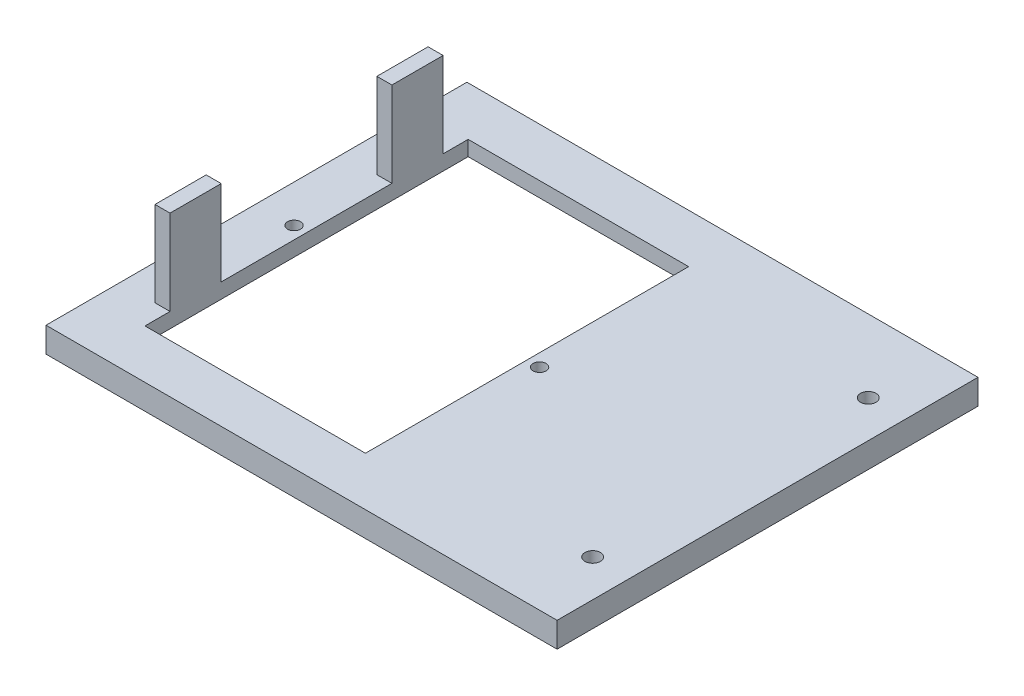
ISO-10303-21;
HEADER;
FILE_DESCRIPTION(('STEP AP214'),'2;1');
FILE_NAME('part.step','',(''),(''),'','','');
FILE_SCHEMA(('AUTOMOTIVE_DESIGN { 1 0 10303 214 1 1 1 1 }'));
ENDSEC;
DATA;
#1=APPLICATION_CONTEXT('core data for automotive mechanical design processes');
#2=APPLICATION_PROTOCOL_DEFINITION('international standard','automotive_design',2000,#1);
#3=PRODUCT_CONTEXT('',#1,'mechanical');
#4=PRODUCT('Part','Part','',(#3));
#5=PRODUCT_RELATED_PRODUCT_CATEGORY('part','',(#4));
#6=PRODUCT_DEFINITION_FORMATION('','',#4);
#7=PRODUCT_DEFINITION_CONTEXT('part definition',#1,'design');
#8=PRODUCT_DEFINITION('design','',#6,#7);
#9=PRODUCT_DEFINITION_SHAPE('','',#8);
#10=(LENGTH_UNIT() NAMED_UNIT(*) SI_UNIT(.MILLI.,.METRE.));
#11=(NAMED_UNIT(*) PLANE_ANGLE_UNIT() SI_UNIT($,.RADIAN.));
#12=(NAMED_UNIT(*) SI_UNIT($,.STERADIAN.) SOLID_ANGLE_UNIT());
#13=UNCERTAINTY_MEASURE_WITH_UNIT(LENGTH_MEASURE(1.E-05),#10,'distance_accuracy_value','');
#14=(GEOMETRIC_REPRESENTATION_CONTEXT(3) GLOBAL_UNCERTAINTY_ASSIGNED_CONTEXT((#13)) GLOBAL_UNIT_ASSIGNED_CONTEXT((#10,
#11,#12)) REPRESENTATION_CONTEXT('',''));
#15=CARTESIAN_POINT('',(0.,0.,0.));
#16=DIRECTION('',(0.,0.,1.));
#17=DIRECTION('',(1.,0.,0.));
#18=AXIS2_PLACEMENT_3D('',#15,#16,#17);
#19=CARTESIAN_POINT('',(0.,5.,0.));
#20=DIRECTION('',(0.,1.,0.));
#21=DIRECTION('',(0.,0.,1.));
#22=AXIS2_PLACEMENT_3D('',#19,#20,#21);
#23=PLANE('',#22);
#24=CARTESIAN_POINT('',(-47.5,5.,0.));
#25=DIRECTION('',(0.,1.,0.));
#26=DIRECTION('',(0.,0.,1.));
#27=AXIS2_PLACEMENT_3D('',#24,#25,#26);
#28=CIRCLE('',#27,1.3);
#29=CARTESIAN_POINT('',(-47.5,5.,1.30000000000001));
#30=VERTEX_POINT('',#29);
#31=EDGE_CURVE('E352',#30,#30,#28,.F.);
#32=ORIENTED_EDGE('',*,*,#31,.T.);
#33=EDGE_LOOP('',(#32));
#34=FACE_BOUND('',#33,.T.);
#35=CARTESIAN_POINT('',(1.50000000000001,5.,0.));
#36=DIRECTION('',(0.,1.,0.));
#37=DIRECTION('',(0.,0.,1.));
#38=AXIS2_PLACEMENT_3D('',#35,#36,#37);
#39=CIRCLE('',#38,1.3);
#40=CARTESIAN_POINT('',(1.50000000000001,5.,1.3));
#41=VERTEX_POINT('',#40);
#42=EDGE_CURVE('E346',#41,#41,#39,.F.);
#43=ORIENTED_EDGE('',*,*,#42,.T.);
#44=EDGE_LOOP('',(#43));
#45=FACE_BOUND('',#44,.T.);
#46=DIRECTION('',(-1.,0.,0.));
#47=VECTOR('',#46,1.);
#48=CARTESIAN_POINT('',(0.,5.,27.25));
#49=LINE('',#48,#47);
#50=CARTESIAN_POINT('',(-45.,5.,27.25));
#51=VERTEX_POINT('',#50);
#52=CARTESIAN_POINT('',(-48.,5.,27.25));
#53=VERTEX_POINT('',#52);
#54=EDGE_CURVE('E295',#51,#53,#49,.T.);
#55=ORIENTED_EDGE('',*,*,#54,.T.);
#56=DIRECTION('',(0.,0.,-1.));
#57=VECTOR('',#56,1.);
#58=CARTESIAN_POINT('',(-48.,5.,0.));
#59=LINE('',#58,#57);
#60=CARTESIAN_POINT('',(-48.,5.,17.0363673677213));
#61=VERTEX_POINT('',#60);
#62=EDGE_CURVE('E288',#53,#61,#59,.T.);
#63=ORIENTED_EDGE('',*,*,#62,.T.);
#64=DIRECTION('',(-1.,0.,0.));
#65=VECTOR('',#64,1.);
#66=CARTESIAN_POINT('',(0.,5.,17.0363673677213));
#67=LINE('',#66,#65);
#68=CARTESIAN_POINT('',(-45.,5.,17.0363673677213));
#69=VERTEX_POINT('',#68);
#70=EDGE_CURVE('E292',#69,#61,#67,.T.);
#71=ORIENTED_EDGE('',*,*,#70,.F.);
#72=DIRECTION('',(0.,0.,1.));
#73=VECTOR('',#72,1.);
#74=CARTESIAN_POINT('',(-45.,5.,-32.25));
#75=LINE('',#74,#73);
#76=CARTESIAN_POINT('',(-45.,5.,-17.0363673677213));
#77=VERTEX_POINT('',#76);
#78=EDGE_CURVE('E228',#77,#69,#75,.T.);
#79=ORIENTED_EDGE('',*,*,#78,.F.);
#80=DIRECTION('',(-1.,0.,0.));
#81=VECTOR('',#80,1.);
#82=CARTESIAN_POINT('',(0.,5.,-17.0363673677213));
#83=LINE('',#82,#81);
#84=CARTESIAN_POINT('',(-48.,5.,-17.0363673677213));
#85=VERTEX_POINT('',#84);
#86=EDGE_CURVE('E261',#77,#85,#83,.T.);
#87=ORIENTED_EDGE('',*,*,#86,.T.);
#88=DIRECTION('',(0.,0.,1.));
#89=VECTOR('',#88,1.);
#90=CARTESIAN_POINT('',(-48.,5.,0.));
#91=LINE('',#90,#89);
#92=CARTESIAN_POINT('',(-48.,5.,-27.25));
#93=VERTEX_POINT('',#92);
#94=EDGE_CURVE('E264',#93,#85,#91,.T.);
#95=ORIENTED_EDGE('',*,*,#94,.F.);
#96=DIRECTION('',(-1.,0.,0.));
#97=VECTOR('',#96,1.);
#98=CARTESIAN_POINT('',(0.,5.,-27.25));
#99=LINE('',#98,#97);
#100=CARTESIAN_POINT('',(-45.,5.,-27.25));
#101=VERTEX_POINT('',#100);
#102=EDGE_CURVE('E267',#101,#93,#99,.T.);
#103=ORIENTED_EDGE('',*,*,#102,.F.);
#104=CARTESIAN_POINT('',(-45.,5.,-32.25));
#105=VERTEX_POINT('',#104);
#106=EDGE_CURVE('E225',#105,#101,#75,.T.);
#107=ORIENTED_EDGE('',*,*,#106,.F.);
#108=DIRECTION('',(-1.,0.,0.));
#109=VECTOR('',#108,1.);
#110=CARTESIAN_POINT('',(-45.,5.,-32.25));
#111=LINE('',#110,#109);
#112=CARTESIAN_POINT('',(-0.999999999999995,5.,-32.25));
#113=VERTEX_POINT('',#112);
#114=EDGE_CURVE('E230',#113,#105,#111,.T.);
#115=ORIENTED_EDGE('',*,*,#114,.F.);
#116=DIRECTION('',(0.,0.,-1.));
#117=VECTOR('',#116,1.);
#118=CARTESIAN_POINT('',(-0.999999999999995,5.,-32.25));
#119=LINE('',#118,#117);
#120=CARTESIAN_POINT('',(-0.999999999999987,5.,32.25));
#121=VERTEX_POINT('',#120);
#122=EDGE_CURVE('E233',#121,#113,#119,.T.);
#123=ORIENTED_EDGE('',*,*,#122,.F.);
#124=DIRECTION('',(1.,0.,0.));
#125=VECTOR('',#124,1.);
#126=CARTESIAN_POINT('',(-45.,5.,32.25));
#127=LINE('',#126,#125);
#128=CARTESIAN_POINT('',(-45.,5.,32.25));
#129=VERTEX_POINT('',#128);
#130=EDGE_CURVE('E220',#129,#121,#127,.T.);
#131=ORIENTED_EDGE('',*,*,#130,.F.);
#132=EDGE_CURVE('E229',#51,#129,#75,.T.);
#133=ORIENTED_EDGE('',*,*,#132,.F.);
#134=EDGE_LOOP('',(#55,#63,#71,#79,#87,#95,#103,#107,#115,#123,#131,#133));
#135=FACE_BOUND('',#134,.T.);
#136=CARTESIAN_POINT('',(39.6,5.,-27.5));
#137=DIRECTION('',(0.,1.,0.));
#138=DIRECTION('',(0.,0.,1.));
#139=AXIS2_PLACEMENT_3D('',#136,#137,#138);
#140=CIRCLE('',#139,1.55);
#141=CARTESIAN_POINT('',(39.6,5.,-25.95));
#142=VERTEX_POINT('',#141);
#143=EDGE_CURVE('E240',#142,#142,#140,.T.);
#144=ORIENTED_EDGE('',*,*,#143,.F.);
#145=EDGE_LOOP('',(#144));
#146=FACE_BOUND('',#145,.T.);
#147=CARTESIAN_POINT('',(39.6,5.,27.5));
#148=DIRECTION('',(0.,-1.,0.));
#149=DIRECTION('',(0.,0.,-1.));
#150=AXIS2_PLACEMENT_3D('',#147,#148,#149);
#151=CIRCLE('',#150,1.55);
#152=CARTESIAN_POINT('',(39.6,5.,25.95));
#153=VERTEX_POINT('',#152);
#154=EDGE_CURVE('E244',#153,#153,#151,.T.);
#155=ORIENTED_EDGE('',*,*,#154,.T.);
#156=EDGE_LOOP('',(#155));
#157=FACE_BOUND('',#156,.T.);
#158=DIRECTION('',(1.,0.,0.));
#159=VECTOR('',#158,1.);
#160=CARTESIAN_POINT('',(-55.,5.,42.));
#161=LINE('',#160,#159);
#162=CARTESIAN_POINT('',(-55.,5.,42.));
#163=VERTEX_POINT('',#162);
#164=CARTESIAN_POINT('',(47.,5.,42.));
#165=VERTEX_POINT('',#164);
#166=EDGE_CURVE('E203',#163,#165,#161,.T.);
#167=ORIENTED_EDGE('',*,*,#166,.T.);
#168=DIRECTION('',(0.,0.,1.));
#169=VECTOR('',#168,1.);
#170=CARTESIAN_POINT('',(47.,5.,42.));
#171=LINE('',#170,#169);
#172=CARTESIAN_POINT('',(47.,5.,-42.));
#173=VERTEX_POINT('',#172);
#174=EDGE_CURVE('E53',#173,#165,#171,.T.);
#175=ORIENTED_EDGE('',*,*,#174,.F.);
#176=DIRECTION('',(-1.,0.,0.));
#177=VECTOR('',#176,1.);
#178=CARTESIAN_POINT('',(-55.,5.,-42.));
#179=LINE('',#178,#177);
#180=CARTESIAN_POINT('',(-55.,5.,-42.));
#181=VERTEX_POINT('',#180);
#182=EDGE_CURVE('E195',#173,#181,#179,.T.);
#183=ORIENTED_EDGE('',*,*,#182,.T.);
#184=DIRECTION('',(0.,0.,1.));
#185=VECTOR('',#184,1.);
#186=CARTESIAN_POINT('',(-55.,5.,-42.));
#187=LINE('',#186,#185);
#188=EDGE_CURVE('E198',#181,#163,#187,.T.);
#189=ORIENTED_EDGE('',*,*,#188,.T.);
#190=EDGE_LOOP('',(#167,#175,#183,#189));
#191=FACE_BOUND('',#190,.T.);
#192=ADVANCED_FACE('F38',(#34,#45,#135,#146,#157,#191),#23,.T.);
#193=CARTESIAN_POINT('',(0.,0.,0.));
#194=DIRECTION('',(0.,1.,0.));
#195=DIRECTION('',(0.,0.,1.));
#196=AXIS2_PLACEMENT_3D('',#193,#194,#195);
#197=PLANE('',#196);
#198=CARTESIAN_POINT('',(39.6,0.,27.5));
#199=DIRECTION('',(0.,-1.,0.));
#200=DIRECTION('',(0.,0.,-1.));
#201=AXIS2_PLACEMENT_3D('',#198,#199,#200);
#202=CIRCLE('',#201,1.55);
#203=CARTESIAN_POINT('',(39.6,0.,25.95));
#204=VERTEX_POINT('',#203);
#205=EDGE_CURVE('E236',#204,#204,#202,.T.);
#206=ORIENTED_EDGE('',*,*,#205,.F.);
#207=EDGE_LOOP('',(#206));
#208=FACE_BOUND('',#207,.T.);
#209=CARTESIAN_POINT('',(39.6,0.,-27.5));
#210=DIRECTION('',(0.,1.,0.));
#211=DIRECTION('',(0.,0.,1.));
#212=AXIS2_PLACEMENT_3D('',#209,#210,#211);
#213=CIRCLE('',#212,1.55);
#214=CARTESIAN_POINT('',(39.6,0.,-25.95));
#215=VERTEX_POINT('',#214);
#216=EDGE_CURVE('E237',#215,#215,#213,.T.);
#217=ORIENTED_EDGE('',*,*,#216,.T.);
#218=EDGE_LOOP('',(#217));
#219=FACE_BOUND('',#218,.T.);
#220=DIRECTION('',(-1.,0.,0.));
#221=VECTOR('',#220,1.);
#222=CARTESIAN_POINT('',(4.00000000000001,0.,37.25));
#223=LINE('',#222,#221);
#224=CARTESIAN_POINT('',(4.00000000000001,0.,37.25));
#225=VERTEX_POINT('',#224);
#226=CARTESIAN_POINT('',(-50.,0.,37.25));
#227=VERTEX_POINT('',#226);
#228=EDGE_CURVE('E331',#225,#227,#223,.T.);
#229=ORIENTED_EDGE('',*,*,#228,.F.);
#230=DIRECTION('',(0.,0.,1.));
#231=VECTOR('',#230,1.);
#232=CARTESIAN_POINT('',(4.00000000000001,0.,37.25));
#233=LINE('',#232,#231);
#234=CARTESIAN_POINT('',(4.00000000000002,0.,-37.25));
#235=VERTEX_POINT('',#234);
#236=EDGE_CURVE('E61',#235,#225,#233,.T.);
#237=ORIENTED_EDGE('',*,*,#236,.F.);
#238=DIRECTION('',(1.,0.,0.));
#239=VECTOR('',#238,1.);
#240=CARTESIAN_POINT('',(4.00000000000002,0.,-37.25));
#241=LINE('',#240,#239);
#242=CARTESIAN_POINT('',(-50.,0.,-37.25));
#243=VERTEX_POINT('',#242);
#244=EDGE_CURVE('E324',#243,#235,#241,.T.);
#245=ORIENTED_EDGE('',*,*,#244,.F.);
#246=DIRECTION('',(0.,0.,-1.));
#247=VECTOR('',#246,1.);
#248=CARTESIAN_POINT('',(-50.,0.,37.25));
#249=LINE('',#248,#247);
#250=EDGE_CURVE('E328',#227,#243,#249,.T.);
#251=ORIENTED_EDGE('',*,*,#250,.F.);
#252=EDGE_LOOP('',(#229,#237,#245,#251));
#253=FACE_BOUND('',#252,.T.);
#254=DIRECTION('',(0.,0.,-1.));
#255=VECTOR('',#254,1.);
#256=CARTESIAN_POINT('',(47.,0.,42.));
#257=LINE('',#256,#255);
#258=CARTESIAN_POINT('',(47.,0.,42.));
#259=VERTEX_POINT('',#258);
#260=CARTESIAN_POINT('',(47.,0.,-42.));
#261=VERTEX_POINT('',#260);
#262=EDGE_CURVE('E175',#259,#261,#257,.T.);
#263=ORIENTED_EDGE('',*,*,#262,.F.);
#264=DIRECTION('',(1.,0.,0.));
#265=VECTOR('',#264,1.);
#266=CARTESIAN_POINT('',(-55.,0.,42.));
#267=LINE('',#266,#265);
#268=CARTESIAN_POINT('',(-55.,0.,42.));
#269=VERTEX_POINT('',#268);
#270=EDGE_CURVE('E187',#269,#259,#267,.T.);
#271=ORIENTED_EDGE('',*,*,#270,.F.);
#272=DIRECTION('',(0.,0.,1.));
#273=VECTOR('',#272,1.);
#274=CARTESIAN_POINT('',(-55.,0.,-42.));
#275=LINE('',#274,#273);
#276=CARTESIAN_POINT('',(-55.,0.,-42.));
#277=VERTEX_POINT('',#276);
#278=EDGE_CURVE('E196',#277,#269,#275,.T.);
#279=ORIENTED_EDGE('',*,*,#278,.F.);
#280=DIRECTION('',(-1.,0.,0.));
#281=VECTOR('',#280,1.);
#282=CARTESIAN_POINT('',(-55.,0.,-42.));
#283=LINE('',#282,#281);
#284=EDGE_CURVE('E188',#261,#277,#283,.T.);
#285=ORIENTED_EDGE('',*,*,#284,.F.);
#286=EDGE_LOOP('',(#263,#271,#279,#285));
#287=FACE_BOUND('',#286,.T.);
#288=ADVANCED_FACE('F185',(#208,#219,#253,#287),#197,.F.);
#289=CARTESIAN_POINT('',(-55.,5.,-42.));
#290=DIRECTION('',(0.,0.,1.));
#291=DIRECTION('',(1.,0.,0.));
#292=AXIS2_PLACEMENT_3D('',#289,#290,#291);
#293=PLANE('',#292);
#294=DIRECTION('',(0.,1.,0.));
#295=VECTOR('',#294,1.);
#296=CARTESIAN_POINT('',(47.,5.,-42.));
#297=LINE('',#296,#295);
#298=EDGE_CURVE('E189',#261,#173,#297,.T.);
#299=ORIENTED_EDGE('',*,*,#298,.F.);
#300=ORIENTED_EDGE('',*,*,#284,.T.);
#301=DIRECTION('',(0.,-1.,0.));
#302=VECTOR('',#301,1.);
#303=CARTESIAN_POINT('',(-55.,5.,-42.));
#304=LINE('',#303,#302);
#305=EDGE_CURVE('E46',#181,#277,#304,.T.);
#306=ORIENTED_EDGE('',*,*,#305,.F.);
#307=ORIENTED_EDGE('',*,*,#182,.F.);
#308=EDGE_LOOP('',(#299,#300,#306,#307));
#309=FACE_BOUND('',#308,.T.);
#310=ADVANCED_FACE('F40',(#309),#293,.F.);
#311=CARTESIAN_POINT('',(-55.,5.,42.));
#312=DIRECTION('',(0.,0.,-1.));
#313=DIRECTION('',(-1.,0.,0.));
#314=AXIS2_PLACEMENT_3D('',#311,#312,#313);
#315=PLANE('',#314);
#316=DIRECTION('',(0.,-1.,0.));
#317=VECTOR('',#316,1.);
#318=CARTESIAN_POINT('',(47.,5.,42.));
#319=LINE('',#318,#317);
#320=EDGE_CURVE('E172',#165,#259,#319,.T.);
#321=ORIENTED_EDGE('',*,*,#320,.F.);
#322=ORIENTED_EDGE('',*,*,#166,.F.);
#323=DIRECTION('',(0.,-1.,0.));
#324=VECTOR('',#323,1.);
#325=CARTESIAN_POINT('',(-55.,5.,42.));
#326=LINE('',#325,#324);
#327=EDGE_CURVE('E194',#163,#269,#326,.T.);
#328=ORIENTED_EDGE('',*,*,#327,.T.);
#329=ORIENTED_EDGE('',*,*,#270,.T.);
#330=EDGE_LOOP('',(#321,#322,#328,#329));
#331=FACE_BOUND('',#330,.T.);
#332=ADVANCED_FACE('F192',(#331),#315,.F.);
#333=CARTESIAN_POINT('',(-55.,5.,-42.));
#334=DIRECTION('',(1.,0.,0.));
#335=DIRECTION('',(0.,0.,-1.));
#336=AXIS2_PLACEMENT_3D('',#333,#334,#335);
#337=PLANE('',#336);
#338=ORIENTED_EDGE('',*,*,#278,.T.);
#339=ORIENTED_EDGE('',*,*,#327,.F.);
#340=ORIENTED_EDGE('',*,*,#188,.F.);
#341=ORIENTED_EDGE('',*,*,#305,.T.);
#342=EDGE_LOOP('',(#338,#339,#340,#341));
#343=FACE_BOUND('',#342,.T.);
#344=ADVANCED_FACE('F208',(#343),#337,.F.);
#345=CARTESIAN_POINT('',(-0.999999999999995,0.,-32.25));
#346=DIRECTION('',(1.,0.,0.));
#347=DIRECTION('',(0.,0.,-1.));
#348=AXIS2_PLACEMENT_3D('',#345,#346,#347);
#349=PLANE('',#348);
#350=DIRECTION('',(0.,1.,0.));
#351=VECTOR('',#350,1.);
#352=CARTESIAN_POINT('',(-0.999999999999995,0.,-32.25));
#353=LINE('',#352,#351);
#354=CARTESIAN_POINT('',(-0.999999999999995,2.,-32.25));
#355=VERTEX_POINT('',#354);
#356=EDGE_CURVE('E217',#355,#113,#353,.T.);
#357=ORIENTED_EDGE('',*,*,#356,.F.);
#358=DIRECTION('',(0.,0.,1.));
#359=VECTOR('',#358,1.);
#360=CARTESIAN_POINT('',(-0.999999999999995,2.,-32.25));
#361=LINE('',#360,#359);
#362=CARTESIAN_POINT('',(-0.999999999999987,2.,32.25));
#363=VERTEX_POINT('',#362);
#364=EDGE_CURVE('E298',#355,#363,#361,.T.);
#365=ORIENTED_EDGE('',*,*,#364,.T.);
#366=DIRECTION('',(0.,1.,0.));
#367=VECTOR('',#366,1.);
#368=CARTESIAN_POINT('',(-0.999999999999987,0.,32.25));
#369=LINE('',#368,#367);
#370=EDGE_CURVE('E211',#363,#121,#369,.T.);
#371=ORIENTED_EDGE('',*,*,#370,.T.);
#372=ORIENTED_EDGE('',*,*,#122,.T.);
#373=EDGE_LOOP('',(#357,#365,#371,#372));
#374=FACE_BOUND('',#373,.T.);
#375=ADVANCED_FACE('F369',(#374),#349,.F.);
#376=CARTESIAN_POINT('',(-45.,0.,32.25));
#377=DIRECTION('',(0.,0.,1.));
#378=DIRECTION('',(1.,0.,0.));
#379=AXIS2_PLACEMENT_3D('',#376,#377,#378);
#380=PLANE('',#379);
#381=ORIENTED_EDGE('',*,*,#370,.F.);
#382=DIRECTION('',(-1.,0.,0.));
#383=VECTOR('',#382,1.);
#384=CARTESIAN_POINT('',(-45.,2.,32.25));
#385=LINE('',#384,#383);
#386=CARTESIAN_POINT('',(-45.,2.,32.25));
#387=VERTEX_POINT('',#386);
#388=EDGE_CURVE('E309',#363,#387,#385,.T.);
#389=ORIENTED_EDGE('',*,*,#388,.T.);
#390=DIRECTION('',(0.,1.,0.));
#391=VECTOR('',#390,1.);
#392=CARTESIAN_POINT('',(-45.,0.,32.25));
#393=LINE('',#392,#391);
#394=EDGE_CURVE('E212',#387,#129,#393,.T.);
#395=ORIENTED_EDGE('',*,*,#394,.T.);
#396=ORIENTED_EDGE('',*,*,#130,.T.);
#397=EDGE_LOOP('',(#381,#389,#395,#396));
#398=FACE_BOUND('',#397,.T.);
#399=ADVANCED_FACE('F377',(#398),#380,.F.);
#400=CARTESIAN_POINT('',(-45.,0.,-32.25));
#401=DIRECTION('',(-1.,0.,0.));
#402=DIRECTION('',(0.,0.,1.));
#403=AXIS2_PLACEMENT_3D('',#400,#401,#402);
#404=PLANE('',#403);
#405=ORIENTED_EDGE('',*,*,#394,.F.);
#406=DIRECTION('',(0.,0.,-1.));
#407=VECTOR('',#406,1.);
#408=CARTESIAN_POINT('',(-45.,2.,-32.25));
#409=LINE('',#408,#407);
#410=CARTESIAN_POINT('',(-45.,2.,-32.25));
#411=VERTEX_POINT('',#410);
#412=EDGE_CURVE('E312',#387,#411,#409,.T.);
#413=ORIENTED_EDGE('',*,*,#412,.T.);
#414=DIRECTION('',(0.,1.,0.));
#415=VECTOR('',#414,1.);
#416=CARTESIAN_POINT('',(-45.,0.,-32.25));
#417=LINE('',#416,#415);
#418=EDGE_CURVE('E219',#411,#105,#417,.T.);
#419=ORIENTED_EDGE('',*,*,#418,.T.);
#420=ORIENTED_EDGE('',*,*,#106,.T.);
#421=DIRECTION('',(0.,-1.,0.));
#422=VECTOR('',#421,1.);
#423=CARTESIAN_POINT('',(-45.,22.,-27.25));
#424=LINE('',#423,#422);
#425=CARTESIAN_POINT('',(-45.,22.,-27.25));
#426=VERTEX_POINT('',#425);
#427=EDGE_CURVE('E257',#426,#101,#424,.T.);
#428=ORIENTED_EDGE('',*,*,#427,.F.);
#429=DIRECTION('',(0.,0.,-1.));
#430=VECTOR('',#429,1.);
#431=CARTESIAN_POINT('',(-45.,22.,0.));
#432=LINE('',#431,#430);
#433=CARTESIAN_POINT('',(-45.,22.,-17.0363673677213));
#434=VERTEX_POINT('',#433);
#435=EDGE_CURVE('E260',#434,#426,#432,.T.);
#436=ORIENTED_EDGE('',*,*,#435,.F.);
#437=DIRECTION('',(0.,-1.,0.));
#438=VECTOR('',#437,1.);
#439=CARTESIAN_POINT('',(-45.,22.,-17.0363673677213));
#440=LINE('',#439,#438);
#441=EDGE_CURVE('E254',#434,#77,#440,.T.);
#442=ORIENTED_EDGE('',*,*,#441,.T.);
#443=ORIENTED_EDGE('',*,*,#78,.T.);
#444=DIRECTION('',(0.,-1.,0.));
#445=VECTOR('',#444,1.);
#446=CARTESIAN_POINT('',(-45.,22.,17.0363673677213));
#447=LINE('',#446,#445);
#448=CARTESIAN_POINT('',(-45.,22.,17.0363673677213));
#449=VERTEX_POINT('',#448);
#450=EDGE_CURVE('E281',#449,#69,#447,.T.);
#451=ORIENTED_EDGE('',*,*,#450,.F.);
#452=DIRECTION('',(0.,0.,-1.));
#453=VECTOR('',#452,1.);
#454=CARTESIAN_POINT('',(-45.,22.,0.));
#455=LINE('',#454,#453);
#456=CARTESIAN_POINT('',(-45.,22.,27.25));
#457=VERTEX_POINT('',#456);
#458=EDGE_CURVE('E303',#457,#449,#455,.T.);
#459=ORIENTED_EDGE('',*,*,#458,.F.);
#460=DIRECTION('',(0.,-1.,0.));
#461=VECTOR('',#460,1.);
#462=CARTESIAN_POINT('',(-45.,22.,27.25));
#463=LINE('',#462,#461);
#464=EDGE_CURVE('E270',#457,#51,#463,.T.);
#465=ORIENTED_EDGE('',*,*,#464,.T.);
#466=ORIENTED_EDGE('',*,*,#132,.T.);
#467=EDGE_LOOP('',(#405,#413,#419,#420,#428,#436,#442,#443,#451,#459,#465,#466));
#468=FACE_BOUND('',#467,.T.);
#469=ADVANCED_FACE('F382',(#468),#404,.F.);
#470=CARTESIAN_POINT('',(-45.,0.,-32.25));
#471=DIRECTION('',(0.,0.,-1.));
#472=DIRECTION('',(-1.,0.,0.));
#473=AXIS2_PLACEMENT_3D('',#470,#471,#472);
#474=PLANE('',#473);
#475=ORIENTED_EDGE('',*,*,#418,.F.);
#476=DIRECTION('',(1.,0.,0.));
#477=VECTOR('',#476,1.);
#478=CARTESIAN_POINT('',(-45.,2.,-32.25));
#479=LINE('',#478,#477);
#480=EDGE_CURVE('E11',#411,#355,#479,.T.);
#481=ORIENTED_EDGE('',*,*,#480,.T.);
#482=ORIENTED_EDGE('',*,*,#356,.T.);
#483=ORIENTED_EDGE('',*,*,#114,.T.);
#484=EDGE_LOOP('',(#475,#481,#482,#483));
#485=FACE_BOUND('',#484,.T.);
#486=ADVANCED_FACE('F391',(#485),#474,.F.);
#487=CARTESIAN_POINT('',(39.6,0.,-27.5));
#488=DIRECTION('',(0.,1.,0.));
#489=DIRECTION('',(0.,0.,1.));
#490=AXIS2_PLACEMENT_3D('',#487,#488,#489);
#491=CYLINDRICAL_SURFACE('',#490,1.55);
#492=ORIENTED_EDGE('',*,*,#216,.F.);
#493=EDGE_LOOP('',(#492));
#494=FACE_BOUND('',#493,.T.);
#495=ORIENTED_EDGE('',*,*,#143,.T.);
#496=EDGE_LOOP('',(#495));
#497=FACE_BOUND('',#496,.T.);
#498=ADVANCED_FACE('F457',(#494,#497),#491,.F.);
#499=CARTESIAN_POINT('',(39.6,0.,27.5));
#500=DIRECTION('',(0.,1.,0.));
#501=DIRECTION('',(0.,0.,1.));
#502=AXIS2_PLACEMENT_3D('',#499,#500,#501);
#503=CYLINDRICAL_SURFACE('',#502,1.55);
#504=ORIENTED_EDGE('',*,*,#205,.T.);
#505=EDGE_LOOP('',(#504));
#506=FACE_BOUND('',#505,.T.);
#507=ORIENTED_EDGE('',*,*,#154,.F.);
#508=EDGE_LOOP('',(#507));
#509=FACE_BOUND('',#508,.T.);
#510=ADVANCED_FACE('F454',(#506,#509),#503,.F.);
#511=CARTESIAN_POINT('',(0.,22.,-27.25));
#512=DIRECTION('',(0.,0.,1.));
#513=DIRECTION('',(1.,0.,0.));
#514=AXIS2_PLACEMENT_3D('',#511,#512,#513);
#515=PLANE('',#514);
#516=ORIENTED_EDGE('',*,*,#102,.T.);
#517=DIRECTION('',(0.,-1.,0.));
#518=VECTOR('',#517,1.);
#519=CARTESIAN_POINT('',(-48.,22.,-27.25));
#520=LINE('',#519,#518);
#521=CARTESIAN_POINT('',(-48.,22.,-27.25));
#522=VERTEX_POINT('',#521);
#523=EDGE_CURVE('E241',#522,#93,#520,.T.);
#524=ORIENTED_EDGE('',*,*,#523,.F.);
#525=DIRECTION('',(-1.,0.,0.));
#526=VECTOR('',#525,1.);
#527=CARTESIAN_POINT('',(0.,22.,-27.25));
#528=LINE('',#527,#526);
#529=EDGE_CURVE('E263',#426,#522,#528,.T.);
#530=ORIENTED_EDGE('',*,*,#529,.F.);
#531=ORIENTED_EDGE('',*,*,#427,.T.);
#532=EDGE_LOOP('',(#516,#524,#530,#531));
#533=FACE_BOUND('',#532,.T.);
#534=ADVANCED_FACE('F406',(#533),#515,.F.);
#535=CARTESIAN_POINT('',(-48.,22.,0.));
#536=DIRECTION('',(1.,0.,0.));
#537=DIRECTION('',(0.,0.,-1.));
#538=AXIS2_PLACEMENT_3D('',#535,#536,#537);
#539=PLANE('',#538);
#540=ORIENTED_EDGE('',*,*,#94,.T.);
#541=DIRECTION('',(0.,-1.,0.));
#542=VECTOR('',#541,1.);
#543=CARTESIAN_POINT('',(-48.,22.,-17.0363673677213));
#544=LINE('',#543,#542);
#545=CARTESIAN_POINT('',(-48.,22.,-17.0363673677213));
#546=VERTEX_POINT('',#545);
#547=EDGE_CURVE('E251',#546,#85,#544,.T.);
#548=ORIENTED_EDGE('',*,*,#547,.F.);
#549=DIRECTION('',(0.,0.,1.));
#550=VECTOR('',#549,1.);
#551=CARTESIAN_POINT('',(-48.,22.,0.));
#552=LINE('',#551,#550);
#553=EDGE_CURVE('E275',#522,#546,#552,.T.);
#554=ORIENTED_EDGE('',*,*,#553,.F.);
#555=ORIENTED_EDGE('',*,*,#523,.T.);
#556=EDGE_LOOP('',(#540,#548,#554,#555));
#557=FACE_BOUND('',#556,.T.);
#558=ADVANCED_FACE('F448',(#557),#539,.F.);
#559=CARTESIAN_POINT('',(0.,22.,-17.0363673677213));
#560=DIRECTION('',(0.,0.,1.));
#561=DIRECTION('',(1.,0.,0.));
#562=AXIS2_PLACEMENT_3D('',#559,#560,#561);
#563=PLANE('',#562);
#564=ORIENTED_EDGE('',*,*,#86,.F.);
#565=ORIENTED_EDGE('',*,*,#441,.F.);
#566=DIRECTION('',(-1.,0.,0.));
#567=VECTOR('',#566,1.);
#568=CARTESIAN_POINT('',(0.,22.,-17.0363673677213));
#569=LINE('',#568,#567);
#570=EDGE_CURVE('E272',#434,#546,#569,.T.);
#571=ORIENTED_EDGE('',*,*,#570,.T.);
#572=ORIENTED_EDGE('',*,*,#547,.T.);
#573=EDGE_LOOP('',(#564,#565,#571,#572));
#574=FACE_BOUND('',#573,.T.);
#575=ADVANCED_FACE('F416',(#574),#563,.T.);
#576=CARTESIAN_POINT('',(0.,22.,0.));
#577=DIRECTION('',(0.,1.,0.));
#578=DIRECTION('',(0.,0.,1.));
#579=AXIS2_PLACEMENT_3D('',#576,#577,#578);
#580=PLANE('',#579);
#581=ORIENTED_EDGE('',*,*,#529,.T.);
#582=ORIENTED_EDGE('',*,*,#553,.T.);
#583=ORIENTED_EDGE('',*,*,#570,.F.);
#584=ORIENTED_EDGE('',*,*,#435,.T.);
#585=EDGE_LOOP('',(#581,#582,#583,#584));
#586=FACE_BOUND('',#585,.T.);
#587=ADVANCED_FACE('F409',(#586),#580,.T.);
#588=CARTESIAN_POINT('',(0.,22.,27.25));
#589=DIRECTION('',(0.,0.,1.));
#590=DIRECTION('',(1.,0.,0.));
#591=AXIS2_PLACEMENT_3D('',#588,#589,#590);
#592=PLANE('',#591);
#593=ORIENTED_EDGE('',*,*,#54,.F.);
#594=ORIENTED_EDGE('',*,*,#464,.F.);
#595=DIRECTION('',(-1.,0.,0.));
#596=VECTOR('',#595,1.);
#597=CARTESIAN_POINT('',(0.,22.,27.25));
#598=LINE('',#597,#596);
#599=CARTESIAN_POINT('',(-48.,22.,27.25));
#600=VERTEX_POINT('',#599);
#601=EDGE_CURVE('E291',#457,#600,#598,.T.);
#602=ORIENTED_EDGE('',*,*,#601,.T.);
#603=DIRECTION('',(0.,-1.,0.));
#604=VECTOR('',#603,1.);
#605=CARTESIAN_POINT('',(-48.,22.,27.25));
#606=LINE('',#605,#604);
#607=EDGE_CURVE('E285',#600,#53,#606,.T.);
#608=ORIENTED_EDGE('',*,*,#607,.T.);
#609=EDGE_LOOP('',(#593,#594,#602,#608));
#610=FACE_BOUND('',#609,.T.);
#611=ADVANCED_FACE('F429',(#610),#592,.T.);
#612=CARTESIAN_POINT('',(0.,22.,17.0363673677213));
#613=DIRECTION('',(0.,0.,1.));
#614=DIRECTION('',(1.,0.,0.));
#615=AXIS2_PLACEMENT_3D('',#612,#613,#614);
#616=PLANE('',#615);
#617=ORIENTED_EDGE('',*,*,#70,.T.);
#618=DIRECTION('',(0.,-1.,0.));
#619=VECTOR('',#618,1.);
#620=CARTESIAN_POINT('',(-48.,22.,17.0363673677213));
#621=LINE('',#620,#619);
#622=CARTESIAN_POINT('',(-48.,22.,17.0363673677213));
#623=VERTEX_POINT('',#622);
#624=EDGE_CURVE('E283',#623,#61,#621,.T.);
#625=ORIENTED_EDGE('',*,*,#624,.F.);
#626=DIRECTION('',(-1.,0.,0.));
#627=VECTOR('',#626,1.);
#628=CARTESIAN_POINT('',(0.,22.,17.0363673677213));
#629=LINE('',#628,#627);
#630=EDGE_CURVE('E301',#449,#623,#629,.T.);
#631=ORIENTED_EDGE('',*,*,#630,.F.);
#632=ORIENTED_EDGE('',*,*,#450,.T.);
#633=EDGE_LOOP('',(#617,#625,#631,#632));
#634=FACE_BOUND('',#633,.T.);
#635=ADVANCED_FACE('F421',(#634),#616,.F.);
#636=CARTESIAN_POINT('',(-48.,22.,0.));
#637=DIRECTION('',(-1.,0.,0.));
#638=DIRECTION('',(0.,0.,1.));
#639=AXIS2_PLACEMENT_3D('',#636,#637,#638);
#640=PLANE('',#639);
#641=ORIENTED_EDGE('',*,*,#62,.F.);
#642=ORIENTED_EDGE('',*,*,#607,.F.);
#643=DIRECTION('',(0.,0.,-1.));
#644=VECTOR('',#643,1.);
#645=CARTESIAN_POINT('',(-48.,22.,0.));
#646=LINE('',#645,#644);
#647=EDGE_CURVE('E287',#600,#623,#646,.T.);
#648=ORIENTED_EDGE('',*,*,#647,.T.);
#649=ORIENTED_EDGE('',*,*,#624,.T.);
#650=EDGE_LOOP('',(#641,#642,#648,#649));
#651=FACE_BOUND('',#650,.T.);
#652=ADVANCED_FACE('F431',(#651),#640,.T.);
#653=CARTESIAN_POINT('',(0.,22.,0.));
#654=DIRECTION('',(0.,1.,0.));
#655=DIRECTION('',(0.,0.,1.));
#656=AXIS2_PLACEMENT_3D('',#653,#654,#655);
#657=PLANE('',#656);
#658=ORIENTED_EDGE('',*,*,#601,.F.);
#659=ORIENTED_EDGE('',*,*,#458,.T.);
#660=ORIENTED_EDGE('',*,*,#630,.T.);
#661=ORIENTED_EDGE('',*,*,#647,.F.);
#662=EDGE_LOOP('',(#658,#659,#660,#661));
#663=FACE_BOUND('',#662,.T.);
#664=ADVANCED_FACE('F427',(#663),#657,.T.);
#665=CARTESIAN_POINT('',(0.,2.,0.));
#666=DIRECTION('',(0.,1.,0.));
#667=DIRECTION('',(0.,0.,1.));
#668=AXIS2_PLACEMENT_3D('',#665,#666,#667);
#669=PLANE('',#668);
#670=CARTESIAN_POINT('',(-47.5,2.,0.));
#671=DIRECTION('',(0.,-1.,0.));
#672=DIRECTION('',(0.,0.,-1.));
#673=AXIS2_PLACEMENT_3D('',#670,#671,#672);
#674=CIRCLE('',#673,1.3);
#675=CARTESIAN_POINT('',(-47.5,2.,-1.29999999999999));
#676=VERTEX_POINT('',#675);
#677=EDGE_CURVE('E335',#676,#676,#674,.T.);
#678=ORIENTED_EDGE('',*,*,#677,.F.);
#679=EDGE_LOOP('',(#678));
#680=FACE_BOUND('',#679,.T.);
#681=CARTESIAN_POINT('',(1.50000000000001,2.,0.));
#682=DIRECTION('',(0.,-1.,0.));
#683=DIRECTION('',(0.,0.,-1.));
#684=AXIS2_PLACEMENT_3D('',#681,#682,#683);
#685=CIRCLE('',#684,1.3);
#686=CARTESIAN_POINT('',(1.50000000000001,2.,-1.3));
#687=VERTEX_POINT('',#686);
#688=EDGE_CURVE('E349',#687,#687,#685,.T.);
#689=ORIENTED_EDGE('',*,*,#688,.F.);
#690=EDGE_LOOP('',(#689));
#691=FACE_BOUND('',#690,.T.);
#692=DIRECTION('',(0.,0.,1.));
#693=VECTOR('',#692,1.);
#694=CARTESIAN_POINT('',(4.00000000000001,2.,37.25));
#695=LINE('',#694,#693);
#696=CARTESIAN_POINT('',(4.00000000000002,2.,-37.25));
#697=VERTEX_POINT('',#696);
#698=CARTESIAN_POINT('',(4.00000000000001,2.,37.25));
#699=VERTEX_POINT('',#698);
#700=EDGE_CURVE('E327',#697,#699,#695,.T.);
#701=ORIENTED_EDGE('',*,*,#700,.T.);
#702=DIRECTION('',(-1.,0.,0.));
#703=VECTOR('',#702,1.);
#704=CARTESIAN_POINT('',(4.00000000000001,2.,37.25));
#705=LINE('',#704,#703);
#706=CARTESIAN_POINT('',(-50.,2.,37.25));
#707=VERTEX_POINT('',#706);
#708=EDGE_CURVE('E341',#699,#707,#705,.T.);
#709=ORIENTED_EDGE('',*,*,#708,.T.);
#710=DIRECTION('',(0.,0.,-1.));
#711=VECTOR('',#710,1.);
#712=CARTESIAN_POINT('',(-50.,2.,37.25));
#713=LINE('',#712,#711);
#714=CARTESIAN_POINT('',(-50.,2.,-37.25));
#715=VERTEX_POINT('',#714);
#716=EDGE_CURVE('E338',#707,#715,#713,.T.);
#717=ORIENTED_EDGE('',*,*,#716,.T.);
#718=DIRECTION('',(1.,0.,0.));
#719=VECTOR('',#718,1.);
#720=CARTESIAN_POINT('',(4.00000000000002,2.,-37.25));
#721=LINE('',#720,#719);
#722=EDGE_CURVE('E319',#715,#697,#721,.T.);
#723=ORIENTED_EDGE('',*,*,#722,.T.);
#724=EDGE_LOOP('',(#701,#709,#717,#723));
#725=FACE_BOUND('',#724,.T.);
#726=ORIENTED_EDGE('',*,*,#480,.F.);
#727=ORIENTED_EDGE('',*,*,#412,.F.);
#728=ORIENTED_EDGE('',*,*,#388,.F.);
#729=ORIENTED_EDGE('',*,*,#364,.F.);
#730=EDGE_LOOP('',(#726,#727,#728,#729));
#731=FACE_BOUND('',#730,.T.);
#732=ADVANCED_FACE('F394',(#680,#691,#725,#731),#669,.F.);
#733=CARTESIAN_POINT('',(4.00000000000001,2.,37.25));
#734=DIRECTION('',(1.,0.,0.));
#735=DIRECTION('',(0.,0.,-1.));
#736=AXIS2_PLACEMENT_3D('',#733,#734,#735);
#737=PLANE('',#736);
#738=ORIENTED_EDGE('',*,*,#236,.T.);
#739=DIRECTION('',(0.,-1.,0.));
#740=VECTOR('',#739,1.);
#741=CARTESIAN_POINT('',(4.00000000000001,2.,37.25));
#742=LINE('',#741,#740);
#743=EDGE_CURVE('E316',#699,#225,#742,.T.);
#744=ORIENTED_EDGE('',*,*,#743,.F.);
#745=ORIENTED_EDGE('',*,*,#700,.F.);
#746=DIRECTION('',(0.,-1.,0.));
#747=VECTOR('',#746,1.);
#748=CARTESIAN_POINT('',(4.00000000000002,2.,-37.25));
#749=LINE('',#748,#747);
#750=EDGE_CURVE('E315',#697,#235,#749,.T.);
#751=ORIENTED_EDGE('',*,*,#750,.T.);
#752=EDGE_LOOP('',(#738,#744,#745,#751));
#753=FACE_BOUND('',#752,.T.);
#754=ADVANCED_FACE('F566',(#753),#737,.F.);
#755=CARTESIAN_POINT('',(4.00000000000002,2.,-37.25));
#756=DIRECTION('',(0.,0.,-1.));
#757=DIRECTION('',(-1.,0.,0.));
#758=AXIS2_PLACEMENT_3D('',#755,#756,#757);
#759=PLANE('',#758);
#760=ORIENTED_EDGE('',*,*,#244,.T.);
#761=ORIENTED_EDGE('',*,*,#750,.F.);
#762=ORIENTED_EDGE('',*,*,#722,.F.);
#763=DIRECTION('',(0.,-1.,0.));
#764=VECTOR('',#763,1.);
#765=CARTESIAN_POINT('',(-50.,2.,-37.25));
#766=LINE('',#765,#764);
#767=EDGE_CURVE('E321',#715,#243,#766,.T.);
#768=ORIENTED_EDGE('',*,*,#767,.T.);
#769=EDGE_LOOP('',(#760,#761,#762,#768));
#770=FACE_BOUND('',#769,.T.);
#771=ADVANCED_FACE('F574',(#770),#759,.F.);
#772=CARTESIAN_POINT('',(-50.,2.,37.25));
#773=DIRECTION('',(-1.,0.,0.));
#774=DIRECTION('',(0.,0.,1.));
#775=AXIS2_PLACEMENT_3D('',#772,#773,#774);
#776=PLANE('',#775);
#777=ORIENTED_EDGE('',*,*,#250,.T.);
#778=ORIENTED_EDGE('',*,*,#767,.F.);
#779=ORIENTED_EDGE('',*,*,#716,.F.);
#780=DIRECTION('',(0.,-1.,0.));
#781=VECTOR('',#780,1.);
#782=CARTESIAN_POINT('',(-50.,2.,37.25));
#783=LINE('',#782,#781);
#784=EDGE_CURVE('E318',#707,#227,#783,.T.);
#785=ORIENTED_EDGE('',*,*,#784,.T.);
#786=EDGE_LOOP('',(#777,#778,#779,#785));
#787=FACE_BOUND('',#786,.T.);
#788=ADVANCED_FACE('F580',(#787),#776,.F.);
#789=CARTESIAN_POINT('',(4.00000000000001,2.,37.25));
#790=DIRECTION('',(0.,0.,1.));
#791=DIRECTION('',(1.,0.,0.));
#792=AXIS2_PLACEMENT_3D('',#789,#790,#791);
#793=PLANE('',#792);
#794=ORIENTED_EDGE('',*,*,#228,.T.);
#795=ORIENTED_EDGE('',*,*,#784,.F.);
#796=ORIENTED_EDGE('',*,*,#708,.F.);
#797=ORIENTED_EDGE('',*,*,#743,.T.);
#798=EDGE_LOOP('',(#794,#795,#796,#797));
#799=FACE_BOUND('',#798,.T.);
#800=ADVANCED_FACE('F588',(#799),#793,.F.);
#801=CARTESIAN_POINT('',(1.50000000000001,22.001,0.));
#802=DIRECTION('',(0.,-1.,0.));
#803=DIRECTION('',(0.,0.,-1.));
#804=AXIS2_PLACEMENT_3D('',#801,#802,#803);
#805=CYLINDRICAL_SURFACE('',#804,1.3);
#806=ORIENTED_EDGE('',*,*,#42,.F.);
#807=EDGE_LOOP('',(#806));
#808=FACE_BOUND('',#807,.T.);
#809=ORIENTED_EDGE('',*,*,#688,.T.);
#810=EDGE_LOOP('',(#809));
#811=FACE_BOUND('',#810,.T.);
#812=ADVANCED_FACE('F595',(#808,#811),#805,.F.);
#813=CARTESIAN_POINT('',(-47.5,22.001,0.));
#814=DIRECTION('',(0.,-1.,0.));
#815=DIRECTION('',(0.,0.,-1.));
#816=AXIS2_PLACEMENT_3D('',#813,#814,#815);
#817=CYLINDRICAL_SURFACE('',#816,1.3);
#818=ORIENTED_EDGE('',*,*,#31,.F.);
#819=EDGE_LOOP('',(#818));
#820=FACE_BOUND('',#819,.T.);
#821=ORIENTED_EDGE('',*,*,#677,.T.);
#822=EDGE_LOOP('',(#821));
#823=FACE_BOUND('',#822,.T.);
#824=ADVANCED_FACE('F602',(#820,#823),#817,.F.);
#825=CARTESIAN_POINT('',(47.,0.,0.));
#826=DIRECTION('',(1.,0.,0.));
#827=DIRECTION('',(0.,0.,-1.));
#828=AXIS2_PLACEMENT_3D('',#825,#826,#827);
#829=PLANE('',#828);
#830=ORIENTED_EDGE('',*,*,#320,.T.);
#831=ORIENTED_EDGE('',*,*,#262,.T.);
#832=ORIENTED_EDGE('',*,*,#298,.T.);
#833=ORIENTED_EDGE('',*,*,#174,.T.);
#834=EDGE_LOOP('',(#830,#831,#832,#833));
#835=FACE_BOUND('',#834,.T.);
#836=ADVANCED_FACE('F174',(#835),#829,.T.);
#837=CLOSED_SHELL('',(#192,#288,#310,#332,#344,#375,#399,#469,#486,#498,#510,#534,#558,#575,
#587,#611,#635,#652,#664,#732,#754,#771,#788,#800,#812,#824,#836));
#838=MANIFOLD_SOLID_BREP('B2',#837);
#839=ADVANCED_BREP_SHAPE_REPRESENTATION('',(#18,#838),#14);
#840=SHAPE_DEFINITION_REPRESENTATION(#9,#839);
ENDSEC;
END-ISO-10303-21;
